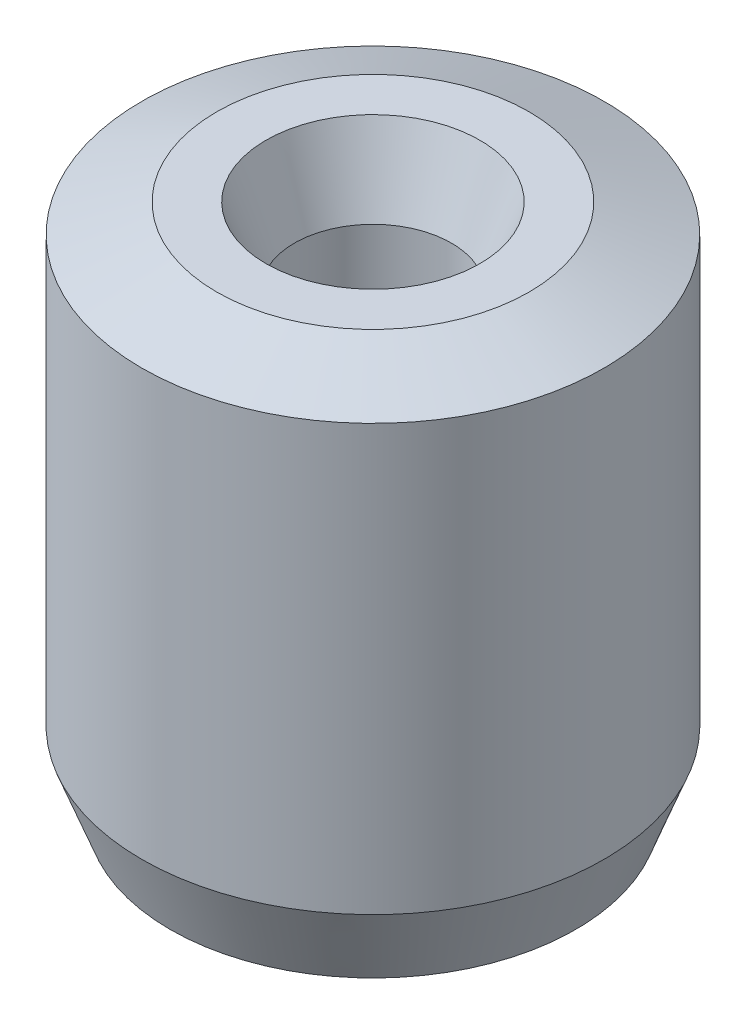
ISO-10303-21;
HEADER;
FILE_DESCRIPTION(('STEP AP214'),'2;1');
FILE_NAME('part.step','',(''),(''),'','','');
FILE_SCHEMA(('AUTOMOTIVE_DESIGN { 1 0 10303 214 1 1 1 1 }'));
ENDSEC;
DATA;
#1=APPLICATION_CONTEXT('core data for automotive mechanical design processes');
#2=APPLICATION_PROTOCOL_DEFINITION('international standard','automotive_design',2000,#1);
#3=PRODUCT_CONTEXT('',#1,'mechanical');
#4=PRODUCT('Part','Part','',(#3));
#5=PRODUCT_RELATED_PRODUCT_CATEGORY('part','',(#4));
#6=PRODUCT_DEFINITION_FORMATION('','',#4);
#7=PRODUCT_DEFINITION_CONTEXT('part definition',#1,'design');
#8=PRODUCT_DEFINITION('design','',#6,#7);
#9=PRODUCT_DEFINITION_SHAPE('','',#8);
#10=(LENGTH_UNIT() NAMED_UNIT(*) SI_UNIT(.MILLI.,.METRE.));
#11=(NAMED_UNIT(*) PLANE_ANGLE_UNIT() SI_UNIT($,.RADIAN.));
#12=(NAMED_UNIT(*) SI_UNIT($,.STERADIAN.) SOLID_ANGLE_UNIT());
#13=UNCERTAINTY_MEASURE_WITH_UNIT(LENGTH_MEASURE(1.E-05),#10,'distance_accuracy_value','');
#14=(GEOMETRIC_REPRESENTATION_CONTEXT(3) GLOBAL_UNCERTAINTY_ASSIGNED_CONTEXT((#13)) GLOBAL_UNIT_ASSIGNED_CONTEXT((#10,
#11,#12)) REPRESENTATION_CONTEXT('',''));
#15=CARTESIAN_POINT('',(0.,0.,0.));
#16=DIRECTION('',(0.,0.,1.));
#17=DIRECTION('',(1.,0.,0.));
#18=AXIS2_PLACEMENT_3D('',#15,#16,#17);
#19=CARTESIAN_POINT('',(0.,17.160247831452,0.));
#20=DIRECTION('',(0.,-1.,0.));
#21=DIRECTION('',(0.,0.,-1.));
#22=AXIS2_PLACEMENT_3D('',#19,#20,#21);
#23=CYLINDRICAL_SURFACE('',#22,7.5);
#24=CARTESIAN_POINT('',(0.,2.43158823128269,0.));
#25=DIRECTION('',(0.,1.,0.));
#26=DIRECTION('',(0.,0.,1.));
#27=AXIS2_PLACEMENT_3D('',#24,#25,#26);
#28=CIRCLE('',#27,7.5);
#29=CARTESIAN_POINT('',(0.,2.43158823128269,7.5));
#30=VERTEX_POINT('',#29);
#31=EDGE_CURVE('E10',#30,#30,#28,.T.);
#32=ORIENTED_EDGE('',*,*,#31,.T.);
#33=EDGE_LOOP('',(#32));
#34=FACE_BOUND('',#33,.T.);
#35=CARTESIAN_POINT('',(0.,16.2393578987418,0.));
#36=DIRECTION('',(0.,1.,0.));
#37=DIRECTION('',(0.,0.,1.));
#38=AXIS2_PLACEMENT_3D('',#35,#36,#37);
#39=CIRCLE('',#38,7.5);
#40=CARTESIAN_POINT('',(0.,16.2393578987418,7.5));
#41=VERTEX_POINT('',#40);
#42=EDGE_CURVE('E50',#41,#41,#39,.F.);
#43=ORIENTED_EDGE('',*,*,#42,.T.);
#44=EDGE_LOOP('',(#43));
#45=FACE_BOUND('',#44,.T.);
#46=ADVANCED_FACE('F39',(#34,#45),#23,.T.);
#47=CARTESIAN_POINT('',(0.,17.160247831452,0.));
#48=DIRECTION('',(0.,1.,0.));
#49=DIRECTION('',(0.,0.,1.));
#50=AXIS2_PLACEMENT_3D('',#47,#48,#49);
#51=PLANE('',#50);
#52=CARTESIAN_POINT('',(0.,17.160247831452,0.));
#53=DIRECTION('',(0.,1.,0.));
#54=DIRECTION('',(0.,0.,1.));
#55=AXIS2_PLACEMENT_3D('',#52,#53,#54);
#56=CIRCLE('',#55,3.47127135108262);
#57=CARTESIAN_POINT('',(0.,17.160247831452,3.47127135108262));
#58=VERTEX_POINT('',#57);
#59=EDGE_CURVE('E58',#58,#58,#56,.F.);
#60=ORIENTED_EDGE('',*,*,#59,.T.);
#61=EDGE_LOOP('',(#60));
#62=FACE_BOUND('',#61,.T.);
#63=CARTESIAN_POINT('',(0.,17.160247831452,0.));
#64=DIRECTION('',(0.,1.,0.));
#65=DIRECTION('',(0.,0.,1.));
#66=AXIS2_PLACEMENT_3D('',#63,#64,#65);
#67=CIRCLE('',#66,5.06841176871732);
#68=CARTESIAN_POINT('',(0.,17.160247831452,5.06841176871732));
#69=VERTEX_POINT('',#68);
#70=EDGE_CURVE('E61',#69,#69,#67,.T.);
#71=ORIENTED_EDGE('',*,*,#70,.T.);
#72=EDGE_LOOP('',(#71));
#73=FACE_BOUND('',#72,.T.);
#74=ADVANCED_FACE('F88',(#62,#73),#51,.T.);
#75=CARTESIAN_POINT('',(0.,0.,0.));
#76=DIRECTION('',(0.,1.,0.));
#77=DIRECTION('',(0.,0.,1.));
#78=AXIS2_PLACEMENT_3D('',#75,#76,#77);
#79=PLANE('',#78);
#80=CARTESIAN_POINT('',(0.,0.,0.));
#81=DIRECTION('',(0.,1.,0.));
#82=DIRECTION('',(0.,0.,1.));
#83=AXIS2_PLACEMENT_3D('',#80,#81,#82);
#84=CIRCLE('',#83,4.98196964965502);
#85=CARTESIAN_POINT('',(0.,0.,4.98196964965502));
#86=VERTEX_POINT('',#85);
#87=EDGE_CURVE('E51',#86,#86,#84,.T.);
#88=ORIENTED_EDGE('',*,*,#87,.T.);
#89=EDGE_LOOP('',(#88));
#90=FACE_BOUND('',#89,.T.);
#91=CARTESIAN_POINT('',(0.,0.,0.));
#92=DIRECTION('',(0.,1.,0.));
#93=DIRECTION('',(0.,0.,1.));
#94=AXIS2_PLACEMENT_3D('',#91,#92,#93);
#95=CIRCLE('',#94,6.57911006728972);
#96=CARTESIAN_POINT('',(0.,0.,6.57911006728972));
#97=VERTEX_POINT('',#96);
#98=EDGE_CURVE('E54',#97,#97,#95,.F.);
#99=ORIENTED_EDGE('',*,*,#98,.T.);
#100=EDGE_LOOP('',(#99));
#101=FACE_BOUND('',#100,.T.);
#102=ADVANCED_FACE('F83',(#90,#101),#79,.F.);
#103=CARTESIAN_POINT('',(0.,17.160247831452,0.));
#104=DIRECTION('',(0.,-1.,0.));
#105=DIRECTION('',(0.,0.,-1.));
#106=AXIS2_PLACEMENT_3D('',#103,#104,#105);
#107=CYLINDRICAL_SURFACE('',#106,2.55038141837234);
#108=CARTESIAN_POINT('',(0.,14.7286596001694,0.));
#109=DIRECTION('',(0.,1.,0.));
#110=DIRECTION('',(0.,0.,1.));
#111=AXIS2_PLACEMENT_3D('',#108,#109,#110);
#112=CIRCLE('',#111,2.55038141837234);
#113=CARTESIAN_POINT('',(0.,14.7286596001694,2.55038141837234));
#114=VERTEX_POINT('',#113);
#115=EDGE_CURVE('E67',#114,#114,#112,.T.);
#116=ORIENTED_EDGE('',*,*,#115,.T.);
#117=EDGE_LOOP('',(#116));
#118=FACE_BOUND('',#117,.T.);
#119=CARTESIAN_POINT('',(0.,0.920889932710282,0.));
#120=DIRECTION('',(0.,1.,0.));
#121=DIRECTION('',(0.,0.,1.));
#122=AXIS2_PLACEMENT_3D('',#119,#120,#121);
#123=CIRCLE('',#122,2.55038141837234);
#124=CARTESIAN_POINT('',(0.,0.920889932710282,2.55038141837234));
#125=VERTEX_POINT('',#124);
#126=EDGE_CURVE('E69',#125,#125,#123,.F.);
#127=ORIENTED_EDGE('',*,*,#126,.T.);
#128=EDGE_LOOP('',(#127));
#129=FACE_BOUND('',#128,.T.);
#130=ADVANCED_FACE('F71',(#118,#129),#107,.F.);
#131=CARTESIAN_POINT('',(0.,14.7286596001694,0.));
#132=DIRECTION('',(0.,1.,0.));
#133=DIRECTION('',(0.,0.,1.));
#134=AXIS2_PLACEMENT_3D('',#131,#132,#133);
#135=CONICAL_SURFACE('',#134,2.55038141837234,0.362027626764957);
#136=ORIENTED_EDGE('',*,*,#59,.F.);
#137=EDGE_LOOP('',(#136));
#138=FACE_BOUND('',#137,.T.);
#139=ORIENTED_EDGE('',*,*,#115,.F.);
#140=EDGE_LOOP('',(#139));
#141=FACE_BOUND('',#140,.T.);
#142=ADVANCED_FACE('F77',(#138,#141),#135,.F.);
#143=CARTESIAN_POINT('',(0.,0.,0.));
#144=DIRECTION('',(0.,-1.,0.));
#145=DIRECTION('',(0.,0.,-1.));
#146=AXIS2_PLACEMENT_3D('',#143,#144,#145);
#147=CONICAL_SURFACE('',#146,4.98196964965502,1.20876870002994);
#148=ORIENTED_EDGE('',*,*,#126,.F.);
#149=EDGE_LOOP('',(#148));
#150=FACE_BOUND('',#149,.T.);
#151=ORIENTED_EDGE('',*,*,#87,.F.);
#152=EDGE_LOOP('',(#151));
#153=FACE_BOUND('',#152,.T.);
#154=ADVANCED_FACE('F73',(#150,#153),#147,.F.);
#155=CARTESIAN_POINT('',(0.,2.43158823128269,0.));
#156=DIRECTION('',(0.,1.,0.));
#157=DIRECTION('',(0.,0.,1.));
#158=AXIS2_PLACEMENT_3D('',#155,#156,#157);
#159=CONICAL_SURFACE('',#158,7.5,0.362027626764956);
#160=ORIENTED_EDGE('',*,*,#98,.F.);
#161=EDGE_LOOP('',(#160));
#162=FACE_BOUND('',#161,.T.);
#163=ORIENTED_EDGE('',*,*,#31,.F.);
#164=EDGE_LOOP('',(#163));
#165=FACE_BOUND('',#164,.T.);
#166=ADVANCED_FACE('F76',(#162,#165),#159,.T.);
#167=CARTESIAN_POINT('',(0.,17.160247831452,0.));
#168=DIRECTION('',(0.,-1.,0.));
#169=DIRECTION('',(0.,0.,-1.));
#170=AXIS2_PLACEMENT_3D('',#167,#168,#169);
#171=CONICAL_SURFACE('',#170,5.06841176871732,1.20876870002994);
#172=ORIENTED_EDGE('',*,*,#42,.F.);
#173=EDGE_LOOP('',(#172));
#174=FACE_BOUND('',#173,.T.);
#175=ORIENTED_EDGE('',*,*,#70,.F.);
#176=EDGE_LOOP('',(#175));
#177=FACE_BOUND('',#176,.T.);
#178=ADVANCED_FACE('F45',(#174,#177),#171,.T.);
#179=CLOSED_SHELL('',(#46,#74,#102,#130,#142,#154,#166,#178));
#180=MANIFOLD_SOLID_BREP('B2',#179);
#181=ADVANCED_BREP_SHAPE_REPRESENTATION('',(#18,#180),#14);
#182=SHAPE_DEFINITION_REPRESENTATION(#9,#181);
ENDSEC;
END-ISO-10303-21;
